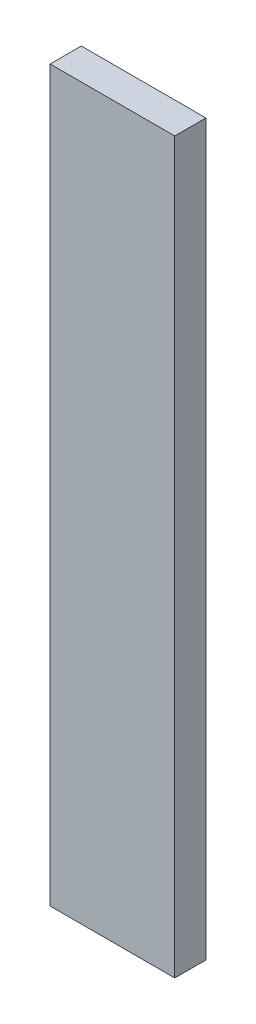
ISO-10303-21;
HEADER;
FILE_DESCRIPTION(('STEP AP214'),'2;1');
FILE_NAME('part.step','',(''),(''),'','','');
FILE_SCHEMA(('AUTOMOTIVE_DESIGN { 1 0 10303 214 1 1 1 1 }'));
ENDSEC;
DATA;
#1=APPLICATION_CONTEXT('core data for automotive mechanical design processes');
#2=APPLICATION_PROTOCOL_DEFINITION('international standard','automotive_design',2000,#1);
#3=PRODUCT_CONTEXT('',#1,'mechanical');
#4=PRODUCT('Part','Part','',(#3));
#5=PRODUCT_RELATED_PRODUCT_CATEGORY('part','',(#4));
#6=PRODUCT_DEFINITION_FORMATION('','',#4);
#7=PRODUCT_DEFINITION_CONTEXT('part definition',#1,'design');
#8=PRODUCT_DEFINITION('design','',#6,#7);
#9=PRODUCT_DEFINITION_SHAPE('','',#8);
#10=(LENGTH_UNIT() NAMED_UNIT(*) SI_UNIT(.MILLI.,.METRE.));
#11=(NAMED_UNIT(*) PLANE_ANGLE_UNIT() SI_UNIT($,.RADIAN.));
#12=(NAMED_UNIT(*) SI_UNIT($,.STERADIAN.) SOLID_ANGLE_UNIT());
#13=UNCERTAINTY_MEASURE_WITH_UNIT(LENGTH_MEASURE(1.E-05),#10,'distance_accuracy_value','');
#14=(GEOMETRIC_REPRESENTATION_CONTEXT(3) GLOBAL_UNCERTAINTY_ASSIGNED_CONTEXT((#13)) GLOBAL_UNIT_ASSIGNED_CONTEXT((#10,
#11,#12)) REPRESENTATION_CONTEXT('',''));
#15=CARTESIAN_POINT('',(0.,0.,0.));
#16=DIRECTION('',(0.,0.,1.));
#17=DIRECTION('',(1.,0.,0.));
#18=AXIS2_PLACEMENT_3D('',#15,#16,#17);
#19=CARTESIAN_POINT('',(-20.,234.,5.));
#20=DIRECTION('',(-1.,0.,0.));
#21=DIRECTION('',(0.,0.,1.));
#22=AXIS2_PLACEMENT_3D('',#19,#20,#21);
#23=PLANE('',#22);
#24=DIRECTION('',(0.,0.,-1.));
#25=VECTOR('',#24,1.);
#26=CARTESIAN_POINT('',(-20.,0.,5.));
#27=LINE('',#26,#25);
#28=CARTESIAN_POINT('',(-20.,0.,5.));
#29=VERTEX_POINT('',#28);
#30=CARTESIAN_POINT('',(-20.,0.,-5.));
#31=VERTEX_POINT('',#30);
#32=EDGE_CURVE('E110',#29,#31,#27,.T.);
#33=ORIENTED_EDGE('',*,*,#32,.F.);
#34=DIRECTION('',(0.,-1.,0.));
#35=VECTOR('',#34,1.);
#36=CARTESIAN_POINT('',(-20.,234.,5.));
#37=LINE('',#36,#35);
#38=CARTESIAN_POINT('',(-20.,234.,5.));
#39=VERTEX_POINT('',#38);
#40=EDGE_CURVE('E11',#39,#29,#37,.T.);
#41=ORIENTED_EDGE('',*,*,#40,.F.);
#42=DIRECTION('',(0.,0.,-1.));
#43=VECTOR('',#42,1.);
#44=CARTESIAN_POINT('',(-20.,234.,5.));
#45=LINE('',#44,#43);
#46=CARTESIAN_POINT('',(-20.,234.,-5.));
#47=VERTEX_POINT('',#46);
#48=EDGE_CURVE('E103',#39,#47,#45,.T.);
#49=ORIENTED_EDGE('',*,*,#48,.T.);
#50=DIRECTION('',(0.,-1.,0.));
#51=VECTOR('',#50,1.);
#52=CARTESIAN_POINT('',(-20.,234.,-5.));
#53=LINE('',#52,#51);
#54=EDGE_CURVE('E42',#47,#31,#53,.T.);
#55=ORIENTED_EDGE('',*,*,#54,.T.);
#56=EDGE_LOOP('',(#33,#41,#49,#55));
#57=FACE_BOUND('',#56,.T.);
#58=ADVANCED_FACE('F39',(#57),#23,.T.);
#59=CARTESIAN_POINT('',(-20.,234.,5.));
#60=DIRECTION('',(0.,0.,-1.));
#61=DIRECTION('',(-1.,0.,0.));
#62=AXIS2_PLACEMENT_3D('',#59,#60,#61);
#63=PLANE('',#62);
#64=DIRECTION('',(1.,0.,0.));
#65=VECTOR('',#64,1.);
#66=CARTESIAN_POINT('',(-20.,0.,5.));
#67=LINE('',#66,#65);
#68=CARTESIAN_POINT('',(20.,0.,5.));
#69=VERTEX_POINT('',#68);
#70=EDGE_CURVE('E73',#29,#69,#67,.T.);
#71=ORIENTED_EDGE('',*,*,#70,.T.);
#72=DIRECTION('',(0.,-1.,0.));
#73=VECTOR('',#72,1.);
#74=CARTESIAN_POINT('',(20.,234.,5.));
#75=LINE('',#74,#73);
#76=CARTESIAN_POINT('',(20.,234.,5.));
#77=VERTEX_POINT('',#76);
#78=EDGE_CURVE('E49',#77,#69,#75,.T.);
#79=ORIENTED_EDGE('',*,*,#78,.F.);
#80=DIRECTION('',(1.,0.,0.));
#81=VECTOR('',#80,1.);
#82=CARTESIAN_POINT('',(-20.,234.,5.));
#83=LINE('',#82,#81);
#84=EDGE_CURVE('E90',#39,#77,#83,.T.);
#85=ORIENTED_EDGE('',*,*,#84,.F.);
#86=ORIENTED_EDGE('',*,*,#40,.T.);
#87=EDGE_LOOP('',(#71,#79,#85,#86));
#88=FACE_BOUND('',#87,.T.);
#89=ADVANCED_FACE('F126',(#88),#63,.F.);
#90=CARTESIAN_POINT('',(20.,234.,5.));
#91=DIRECTION('',(-1.,0.,0.));
#92=DIRECTION('',(0.,0.,1.));
#93=AXIS2_PLACEMENT_3D('',#90,#91,#92);
#94=PLANE('',#93);
#95=DIRECTION('',(0.,0.,-1.));
#96=VECTOR('',#95,1.);
#97=CARTESIAN_POINT('',(20.,0.,5.));
#98=LINE('',#97,#96);
#99=CARTESIAN_POINT('',(20.,0.,-5.));
#100=VERTEX_POINT('',#99);
#101=EDGE_CURVE('E98',#69,#100,#98,.T.);
#102=ORIENTED_EDGE('',*,*,#101,.T.);
#103=DIRECTION('',(0.,-1.,0.));
#104=VECTOR('',#103,1.);
#105=CARTESIAN_POINT('',(20.,234.,-5.));
#106=LINE('',#105,#104);
#107=CARTESIAN_POINT('',(20.,234.,-5.));
#108=VERTEX_POINT('',#107);
#109=EDGE_CURVE('E95',#108,#100,#106,.T.);
#110=ORIENTED_EDGE('',*,*,#109,.F.);
#111=DIRECTION('',(0.,0.,-1.));
#112=VECTOR('',#111,1.);
#113=CARTESIAN_POINT('',(20.,234.,5.));
#114=LINE('',#113,#112);
#115=EDGE_CURVE('E85',#77,#108,#114,.T.);
#116=ORIENTED_EDGE('',*,*,#115,.F.);
#117=ORIENTED_EDGE('',*,*,#78,.T.);
#118=EDGE_LOOP('',(#102,#110,#116,#117));
#119=FACE_BOUND('',#118,.T.);
#120=ADVANCED_FACE('F96',(#119),#94,.F.);
#121=CARTESIAN_POINT('',(-20.,234.,-5.));
#122=DIRECTION('',(0.,0.,-1.));
#123=DIRECTION('',(-1.,0.,0.));
#124=AXIS2_PLACEMENT_3D('',#121,#122,#123);
#125=PLANE('',#124);
#126=DIRECTION('',(1.,0.,0.));
#127=VECTOR('',#126,1.);
#128=CARTESIAN_POINT('',(-20.,0.,-5.));
#129=LINE('',#128,#127);
#130=EDGE_CURVE('E114',#31,#100,#129,.T.);
#131=ORIENTED_EDGE('',*,*,#130,.F.);
#132=ORIENTED_EDGE('',*,*,#54,.F.);
#133=DIRECTION('',(1.,0.,0.));
#134=VECTOR('',#133,1.);
#135=CARTESIAN_POINT('',(-20.,234.,-5.));
#136=LINE('',#135,#134);
#137=EDGE_CURVE('E89',#47,#108,#136,.T.);
#138=ORIENTED_EDGE('',*,*,#137,.T.);
#139=ORIENTED_EDGE('',*,*,#109,.T.);
#140=EDGE_LOOP('',(#131,#132,#138,#139));
#141=FACE_BOUND('',#140,.T.);
#142=ADVANCED_FACE('F101',(#141),#125,.T.);
#143=CARTESIAN_POINT('',(0.,234.,0.));
#144=DIRECTION('',(0.,-1.,0.));
#145=DIRECTION('',(0.,0.,-1.));
#146=AXIS2_PLACEMENT_3D('',#143,#144,#145);
#147=PLANE('',#146);
#148=ORIENTED_EDGE('',*,*,#48,.F.);
#149=ORIENTED_EDGE('',*,*,#84,.T.);
#150=ORIENTED_EDGE('',*,*,#115,.T.);
#151=ORIENTED_EDGE('',*,*,#137,.F.);
#152=EDGE_LOOP('',(#148,#149,#150,#151));
#153=FACE_BOUND('',#152,.T.);
#154=ADVANCED_FACE('F88',(#153),#147,.F.);
#155=CARTESIAN_POINT('',(0.,0.,0.));
#156=DIRECTION('',(0.,-1.,0.));
#157=DIRECTION('',(0.,0.,-1.));
#158=AXIS2_PLACEMENT_3D('',#155,#156,#157);
#159=PLANE('',#158);
#160=ORIENTED_EDGE('',*,*,#32,.T.);
#161=ORIENTED_EDGE('',*,*,#130,.T.);
#162=ORIENTED_EDGE('',*,*,#101,.F.);
#163=ORIENTED_EDGE('',*,*,#70,.F.);
#164=EDGE_LOOP('',(#160,#161,#162,#163));
#165=FACE_BOUND('',#164,.T.);
#166=ADVANCED_FACE('F123',(#165),#159,.T.);
#167=CLOSED_SHELL('',(#58,#89,#120,#142,#154,#166));
#168=MANIFOLD_SOLID_BREP('B2',#167);
#169=ADVANCED_BREP_SHAPE_REPRESENTATION('',(#18,#168),#14);
#170=SHAPE_DEFINITION_REPRESENTATION(#9,#169);
ENDSEC;
END-ISO-10303-21;
